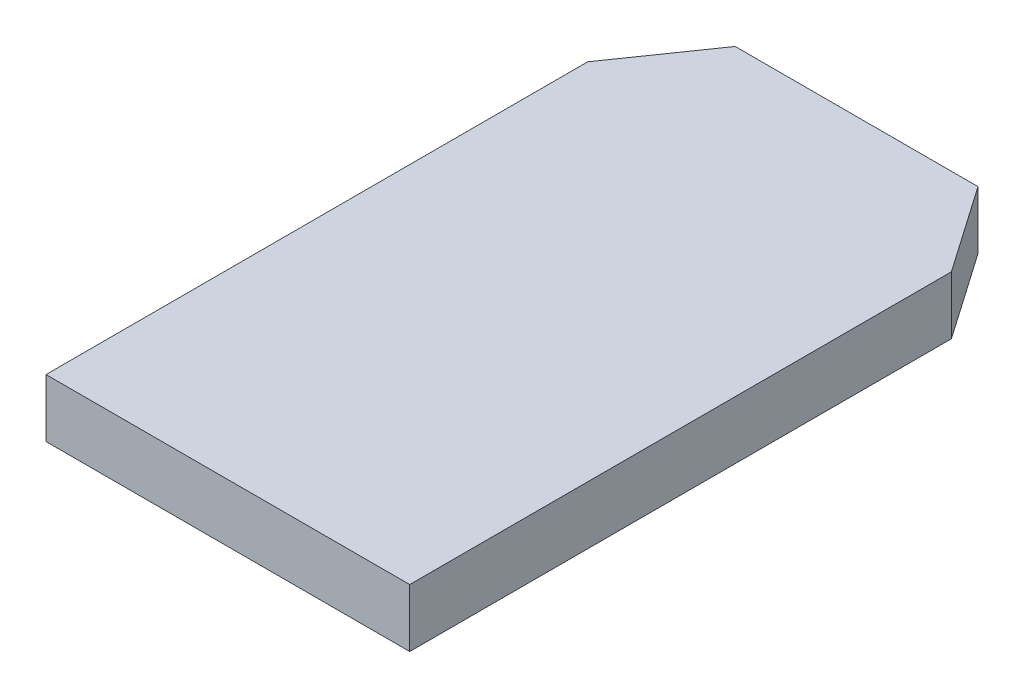
ISO-10303-21;
HEADER;
FILE_DESCRIPTION(('STEP AP214'),'2;1');
FILE_NAME('part.step','',(''),(''),'','','');
FILE_SCHEMA(('AUTOMOTIVE_DESIGN { 1 0 10303 214 1 1 1 1 }'));
ENDSEC;
DATA;
#1=APPLICATION_CONTEXT('core data for automotive mechanical design processes');
#2=APPLICATION_PROTOCOL_DEFINITION('international standard','automotive_design',2000,#1);
#3=PRODUCT_CONTEXT('',#1,'mechanical');
#4=PRODUCT('Part','Part','',(#3));
#5=PRODUCT_RELATED_PRODUCT_CATEGORY('part','',(#4));
#6=PRODUCT_DEFINITION_FORMATION('','',#4);
#7=PRODUCT_DEFINITION_CONTEXT('part definition',#1,'design');
#8=PRODUCT_DEFINITION('design','',#6,#7);
#9=PRODUCT_DEFINITION_SHAPE('','',#8);
#10=(LENGTH_UNIT() NAMED_UNIT(*) SI_UNIT(.MILLI.,.METRE.));
#11=(NAMED_UNIT(*) PLANE_ANGLE_UNIT() SI_UNIT($,.RADIAN.));
#12=(NAMED_UNIT(*) SI_UNIT($,.STERADIAN.) SOLID_ANGLE_UNIT());
#13=UNCERTAINTY_MEASURE_WITH_UNIT(LENGTH_MEASURE(1.E-05),#10,'distance_accuracy_value','');
#14=(GEOMETRIC_REPRESENTATION_CONTEXT(3) GLOBAL_UNCERTAINTY_ASSIGNED_CONTEXT((#13)) GLOBAL_UNIT_ASSIGNED_CONTEXT((#10,
#11,#12)) REPRESENTATION_CONTEXT('',''));
#15=CARTESIAN_POINT('',(0.,0.,0.));
#16=DIRECTION('',(0.,0.,1.));
#17=DIRECTION('',(1.,0.,0.));
#18=AXIS2_PLACEMENT_3D('',#15,#16,#17);
#19=CARTESIAN_POINT('',(-6.00075000000018,17.7990500000004,-12.8778000000013));
#20=DIRECTION('',(0.,-1.,0.));
#21=DIRECTION('',(1.,0.,0.));
#22=AXIS2_PLACEMENT_3D('',#19,#20,#21);
#23=PLANE('',#22);
#24=DIRECTION('',(-0.570395809495345,0.,0.821369965673295));
#25=VECTOR('',#24,1.);
#26=CARTESIAN_POINT('',(-5.60387500000019,17.7990500000004,-20.5613000000013));
#27=LINE('',#26,#25);
#28=CARTESIAN_POINT('',(-5.20700000000018,17.7990500000004,-21.1328000000013));
#29=VERTEX_POINT('',#28);
#30=CARTESIAN_POINT('',(-6.00075000000018,17.7990500000004,-19.9898000000013));
#31=VERTEX_POINT('',#30);
#32=EDGE_CURVE('E67',#29,#31,#27,.T.);
#33=ORIENTED_EDGE('',*,*,#32,.F.);
#34=DIRECTION('',(1.,0.,0.));
#35=VECTOR('',#34,1.);
#36=CARTESIAN_POINT('',(-3.61315000000019,17.7990500000004,-21.1328000000013));
#37=LINE('',#36,#35);
#38=CARTESIAN_POINT('',(-2.01930000000019,17.7990500000004,-21.1328000000013));
#39=VERTEX_POINT('',#38);
#40=EDGE_CURVE('E69',#29,#39,#37,.T.);
#41=ORIENTED_EDGE('',*,*,#40,.T.);
#42=DIRECTION('',(-0.570395809495346,0.,-0.821369965673295));
#43=VECTOR('',#42,1.);
#44=CARTESIAN_POINT('',(-1.62242500000017,17.7990500000004,-20.5613000000013));
#45=LINE('',#44,#43);
#46=CARTESIAN_POINT('',(-1.22555000000018,17.7990500000004,-19.9898000000013));
#47=VERTEX_POINT('',#46);
#48=EDGE_CURVE('E20',#47,#39,#45,.T.);
#49=ORIENTED_EDGE('',*,*,#48,.F.);
#50=DIRECTION('',(0.,0.,-1.));
#51=VECTOR('',#50,1.);
#52=CARTESIAN_POINT('',(-1.22555000000018,17.7990500000004,-12.8778000000013));
#53=LINE('',#52,#51);
#54=CARTESIAN_POINT('',(-1.22555000000018,17.7990500000004,-12.8778000000019));
#55=VERTEX_POINT('',#54);
#56=EDGE_CURVE('E104',#55,#47,#53,.T.);
#57=ORIENTED_EDGE('',*,*,#56,.F.);
#58=DIRECTION('',(-1.,0.,0.));
#59=VECTOR('',#58,1.);
#60=CARTESIAN_POINT('',(-3.01980662698043E-13,17.7990500000004,-12.8778000000025));
#61=LINE('',#60,#59);
#62=CARTESIAN_POINT('',(-6.00075000000018,17.7990500000004,-12.8778000000016));
#63=VERTEX_POINT('',#62);
#64=EDGE_CURVE('E98',#55,#63,#61,.T.);
#65=ORIENTED_EDGE('',*,*,#64,.T.);
#66=DIRECTION('',(0.,0.,1.));
#67=VECTOR('',#66,1.);
#68=CARTESIAN_POINT('',(-6.00075000000018,17.7990500000004,-12.8778000000013));
#69=LINE('',#68,#67);
#70=EDGE_CURVE('E95',#31,#63,#69,.T.);
#71=ORIENTED_EDGE('',*,*,#70,.F.);
#72=EDGE_LOOP('',(#33,#41,#49,#57,#65,#71));
#73=FACE_BOUND('',#72,.T.);
#74=ADVANCED_FACE('F17',(#73),#23,.T.);
#75=CARTESIAN_POINT('',(-1.62242500000017,17.9895500000004,-20.5613000000013));
#76=DIRECTION('',(0.821369965673295,0.,-0.570395809495346));
#77=DIRECTION('',(-0.570395809495346,0.,-0.821369965673295));
#78=AXIS2_PLACEMENT_3D('',#75,#76,#77);
#79=PLANE('',#78);
#80=ORIENTED_EDGE('',*,*,#48,.T.);
#81=DIRECTION('',(0.,1.,0.));
#82=VECTOR('',#81,1.);
#83=CARTESIAN_POINT('',(-2.01930000000019,18.1800500000004,-21.1328000000013));
#84=LINE('',#83,#82);
#85=CARTESIAN_POINT('',(-2.01930000000018,18.5610500000004,-21.1328000000013));
#86=VERTEX_POINT('',#85);
#87=EDGE_CURVE('E76',#39,#86,#84,.T.);
#88=ORIENTED_EDGE('',*,*,#87,.T.);
#89=DIRECTION('',(-0.570395809495349,0.,-0.821369965673293));
#90=VECTOR('',#89,1.);
#91=CARTESIAN_POINT('',(-1.22555000000018,18.5610500000004,-19.9898000000013));
#92=LINE('',#91,#90);
#93=CARTESIAN_POINT('',(-1.22555000000018,18.5610500000004,-19.9898000000013));
#94=VERTEX_POINT('',#93);
#95=EDGE_CURVE('E106',#94,#86,#92,.T.);
#96=ORIENTED_EDGE('',*,*,#95,.F.);
#97=DIRECTION('',(0.,1.,0.));
#98=VECTOR('',#97,1.);
#99=CARTESIAN_POINT('',(-1.22555000000018,17.7990500000004,-19.9898000000013));
#100=LINE('',#99,#98);
#101=EDGE_CURVE('E81',#47,#94,#100,.T.);
#102=ORIENTED_EDGE('',*,*,#101,.F.);
#103=EDGE_LOOP('',(#80,#88,#96,#102));
#104=FACE_BOUND('',#103,.T.);
#105=ADVANCED_FACE('F78',(#104),#79,.T.);
#106=CARTESIAN_POINT('',(-3.61315000000019,18.1800500000004,-21.1328000000013));
#107=DIRECTION('',(0.,0.,1.));
#108=DIRECTION('',(1.,0.,0.));
#109=AXIS2_PLACEMENT_3D('',#106,#107,#108);
#110=PLANE('',#109);
#111=ORIENTED_EDGE('',*,*,#40,.F.);
#112=DIRECTION('',(0.,1.,0.));
#113=VECTOR('',#112,1.);
#114=CARTESIAN_POINT('',(-5.20700000000019,18.3705500000004,-21.1328000000013));
#115=LINE('',#114,#113);
#116=CARTESIAN_POINT('',(-5.20700000000019,18.5610500000004,-21.1328000000013));
#117=VERTEX_POINT('',#116);
#118=EDGE_CURVE('E88',#117,#29,#115,.F.);
#119=ORIENTED_EDGE('',*,*,#118,.F.);
#120=DIRECTION('',(-1.,0.,0.));
#121=VECTOR('',#120,1.);
#122=CARTESIAN_POINT('',(-1.22555000000018,18.5610500000004,-21.1328000000013));
#123=LINE('',#122,#121);
#124=EDGE_CURVE('E85',#86,#117,#123,.T.);
#125=ORIENTED_EDGE('',*,*,#124,.F.);
#126=ORIENTED_EDGE('',*,*,#87,.F.);
#127=EDGE_LOOP('',(#111,#119,#125,#126));
#128=FACE_BOUND('',#127,.T.);
#129=ADVANCED_FACE('F83',(#128),#110,.F.);
#130=CARTESIAN_POINT('',(-5.60387500000019,18.3705500000004,-20.5613000000013));
#131=DIRECTION('',(-0.821369965673295,0.,-0.570395809495345));
#132=DIRECTION('',(-0.570395809495345,0.,0.821369965673295));
#133=AXIS2_PLACEMENT_3D('',#130,#131,#132);
#134=PLANE('',#133);
#135=DIRECTION('',(-0.570395809495339,0.,0.821369965673299));
#136=VECTOR('',#135,1.);
#137=CARTESIAN_POINT('',(-5.20700000000019,18.5610500000004,-21.1328000000013));
#138=LINE('',#137,#136);
#139=CARTESIAN_POINT('',(-6.00075000000018,18.5610500000004,-19.9898000000013));
#140=VERTEX_POINT('',#139);
#141=EDGE_CURVE('E109',#117,#140,#138,.T.);
#142=ORIENTED_EDGE('',*,*,#141,.F.);
#143=ORIENTED_EDGE('',*,*,#118,.T.);
#144=ORIENTED_EDGE('',*,*,#32,.T.);
#145=DIRECTION('',(0.,1.,0.));
#146=VECTOR('',#145,1.);
#147=CARTESIAN_POINT('',(-6.00075000000018,18.5610500000004,-19.9898000000013));
#148=LINE('',#147,#146);
#149=EDGE_CURVE('E92',#140,#31,#148,.F.);
#150=ORIENTED_EDGE('',*,*,#149,.F.);
#151=EDGE_LOOP('',(#142,#143,#144,#150));
#152=FACE_BOUND('',#151,.T.);
#153=ADVANCED_FACE('F137',(#152),#134,.T.);
#154=CARTESIAN_POINT('',(-6.00075000000018,18.5610500000004,-12.8778000000013));
#155=DIRECTION('',(-1.,0.,0.));
#156=DIRECTION('',(0.,0.,1.));
#157=AXIS2_PLACEMENT_3D('',#154,#155,#156);
#158=PLANE('',#157);
#159=DIRECTION('',(0.,1.,0.));
#160=VECTOR('',#159,1.);
#161=CARTESIAN_POINT('',(-6.00075000000018,15.1130000000006,-12.8778000000025));
#162=LINE('',#161,#160);
#163=CARTESIAN_POINT('',(-6.00075000000018,18.5610500000004,-12.8778000000016));
#164=VERTEX_POINT('',#163);
#165=EDGE_CURVE('E100',#63,#164,#162,.T.);
#166=ORIENTED_EDGE('',*,*,#165,.T.);
#167=DIRECTION('',(0.,0.,1.));
#168=VECTOR('',#167,1.);
#169=CARTESIAN_POINT('',(-6.00075000000018,18.5610500000004,-12.8778000000013));
#170=LINE('',#169,#168);
#171=EDGE_CURVE('E112',#140,#164,#170,.T.);
#172=ORIENTED_EDGE('',*,*,#171,.F.);
#173=ORIENTED_EDGE('',*,*,#149,.T.);
#174=ORIENTED_EDGE('',*,*,#70,.T.);
#175=EDGE_LOOP('',(#166,#172,#173,#174));
#176=FACE_BOUND('',#175,.T.);
#177=ADVANCED_FACE('F122',(#176),#158,.T.);
#178=CARTESIAN_POINT('',(-3.01980662698043E-13,15.1130000000006,-12.8778000000025));
#179=DIRECTION('',(0.,0.,-1.));
#180=DIRECTION('',(-1.,0.,0.));
#181=AXIS2_PLACEMENT_3D('',#178,#179,#180);
#182=PLANE('',#181);
#183=ORIENTED_EDGE('',*,*,#165,.F.);
#184=ORIENTED_EDGE('',*,*,#64,.F.);
#185=DIRECTION('',(0.,1.,0.));
#186=VECTOR('',#185,1.);
#187=CARTESIAN_POINT('',(-1.22555000000018,17.7990500000004,-12.8778000000013));
#188=LINE('',#187,#186);
#189=CARTESIAN_POINT('',(-1.22555000000018,18.5610500000004,-12.8778000000019));
#190=VERTEX_POINT('',#189);
#191=EDGE_CURVE('E35',#190,#55,#188,.F.);
#192=ORIENTED_EDGE('',*,*,#191,.F.);
#193=DIRECTION('',(-1.,0.,0.));
#194=VECTOR('',#193,1.);
#195=CARTESIAN_POINT('',(-1.22555000000018,18.5610500000004,-12.8778000000013));
#196=LINE('',#195,#194);
#197=EDGE_CURVE('E26',#164,#190,#196,.F.);
#198=ORIENTED_EDGE('',*,*,#197,.F.);
#199=EDGE_LOOP('',(#183,#184,#192,#198));
#200=FACE_BOUND('',#199,.T.);
#201=ADVANCED_FACE('F120',(#200),#182,.F.);
#202=CARTESIAN_POINT('',(-1.22555000000018,17.7990500000004,-12.8778000000013));
#203=DIRECTION('',(1.,0.,0.));
#204=DIRECTION('',(0.,0.,-1.));
#205=AXIS2_PLACEMENT_3D('',#202,#203,#204);
#206=PLANE('',#205);
#207=ORIENTED_EDGE('',*,*,#191,.T.);
#208=ORIENTED_EDGE('',*,*,#56,.T.);
#209=ORIENTED_EDGE('',*,*,#101,.T.);
#210=DIRECTION('',(0.,0.,1.));
#211=VECTOR('',#210,1.);
#212=CARTESIAN_POINT('',(-1.22555000000018,18.5610500000004,-12.8778000000013));
#213=LINE('',#212,#211);
#214=EDGE_CURVE('E11',#190,#94,#213,.F.);
#215=ORIENTED_EDGE('',*,*,#214,.F.);
#216=EDGE_LOOP('',(#207,#208,#209,#215));
#217=FACE_BOUND('',#216,.T.);
#218=ADVANCED_FACE('F124',(#217),#206,.T.);
#219=CARTESIAN_POINT('',(-1.22555000000018,18.5610500000004,-12.8778000000013));
#220=DIRECTION('',(0.,1.,0.));
#221=DIRECTION('',(-1.,0.,0.));
#222=AXIS2_PLACEMENT_3D('',#219,#220,#221);
#223=PLANE('',#222);
#224=ORIENTED_EDGE('',*,*,#197,.T.);
#225=ORIENTED_EDGE('',*,*,#214,.T.);
#226=ORIENTED_EDGE('',*,*,#95,.T.);
#227=ORIENTED_EDGE('',*,*,#124,.T.);
#228=ORIENTED_EDGE('',*,*,#141,.T.);
#229=ORIENTED_EDGE('',*,*,#171,.T.);
#230=EDGE_LOOP('',(#224,#225,#226,#227,#228,#229));
#231=FACE_BOUND('',#230,.T.);
#232=ADVANCED_FACE('F117',(#231),#223,.T.);
#233=CLOSED_SHELL('',(#74,#105,#129,#153,#177,#201,#218,#232));
#234=MANIFOLD_SOLID_BREP('B1',#233);
#235=ADVANCED_BREP_SHAPE_REPRESENTATION('',(#18,#234),#14);
#236=SHAPE_DEFINITION_REPRESENTATION(#9,#235);
ENDSEC;
END-ISO-10303-21;
